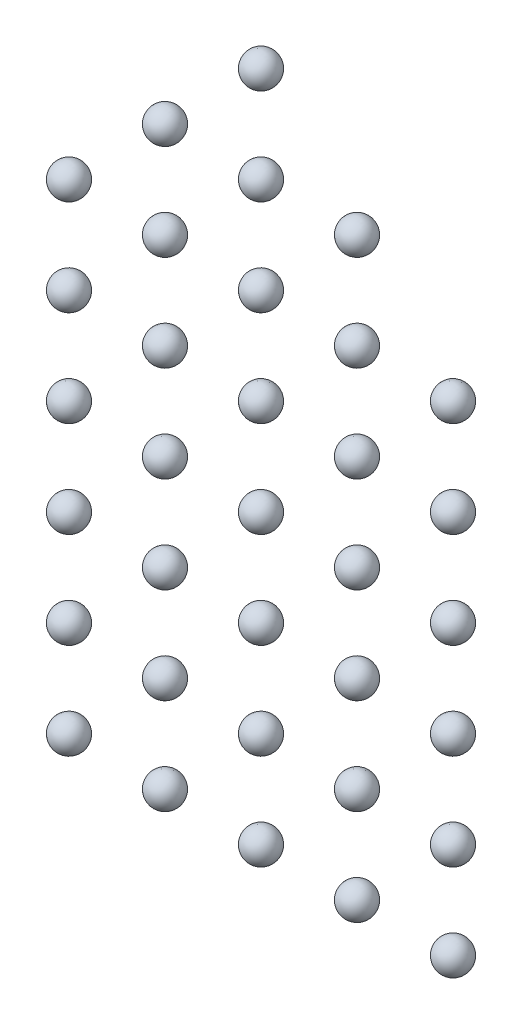
ISO-10303-21;
HEADER;
FILE_DESCRIPTION(('STEP AP214'),'2;1');
FILE_NAME('part.step','',(''),(''),'','','');
FILE_SCHEMA(('AUTOMOTIVE_DESIGN { 1 0 10303 214 1 1 1 1 }'));
ENDSEC;
DATA;
#1=APPLICATION_CONTEXT('core data for automotive mechanical design processes');
#2=APPLICATION_PROTOCOL_DEFINITION('international standard','automotive_design',2000,#1);
#3=PRODUCT_CONTEXT('',#1,'mechanical');
#4=PRODUCT('Part','Part','',(#3));
#5=PRODUCT_RELATED_PRODUCT_CATEGORY('part','',(#4));
#6=PRODUCT_DEFINITION_FORMATION('','',#4);
#7=PRODUCT_DEFINITION_CONTEXT('part definition',#1,'design');
#8=PRODUCT_DEFINITION('design','',#6,#7);
#9=PRODUCT_DEFINITION_SHAPE('','',#8);
#10=(LENGTH_UNIT() NAMED_UNIT(*) SI_UNIT(.MILLI.,.METRE.));
#11=(NAMED_UNIT(*) PLANE_ANGLE_UNIT() SI_UNIT($,.RADIAN.));
#12=(NAMED_UNIT(*) SI_UNIT($,.STERADIAN.) SOLID_ANGLE_UNIT());
#13=UNCERTAINTY_MEASURE_WITH_UNIT(LENGTH_MEASURE(1.E-05),#10,'distance_accuracy_value','');
#14=(GEOMETRIC_REPRESENTATION_CONTEXT(3) GLOBAL_UNCERTAINTY_ASSIGNED_CONTEXT((#13)) GLOBAL_UNIT_ASSIGNED_CONTEXT((#10,
#11,#12)) REPRESENTATION_CONTEXT('',''));
#15=CARTESIAN_POINT('',(0.,0.,0.));
#16=DIRECTION('',(0.,0.,1.));
#17=DIRECTION('',(1.,0.,0.));
#18=AXIS2_PLACEMENT_3D('',#15,#16,#17);
#19=CARTESIAN_POINT('',(6.,21.,0.));
#20=DIRECTION('',(-1.,0.,0.));
#21=DIRECTION('',(0.,1.,0.));
#22=AXIS2_PLACEMENT_3D('',#19,#20,#21);
#23=SPHERICAL_SURFACE('',#22,0.5);
#24=CARTESIAN_POINT('',(5.5,21.,0.));
#25=VERTEX_POINT('',#24);
#26=VERTEX_LOOP('',#25);
#27=FACE_BOUND('',#26,.T.);
#28=ADVANCED_FACE('F44',(#27),#23,.T.);
#29=CLOSED_SHELL('',(#28));
#30=MANIFOLD_SOLID_BREP('B2',#29);
#31=CARTESIAN_POINT('',(3.,18.,0.));
#32=DIRECTION('',(-1.,0.,0.));
#33=DIRECTION('',(0.,1.,0.));
#34=AXIS2_PLACEMENT_3D('',#31,#32,#33);
#35=SPHERICAL_SURFACE('',#34,0.5);
#36=CARTESIAN_POINT('',(2.5,18.,0.));
#37=VERTEX_POINT('',#36);
#38=VERTEX_LOOP('',#37);
#39=FACE_BOUND('',#38,.T.);
#40=ADVANCED_FACE('F65',(#39),#35,.T.);
#41=CLOSED_SHELL('',(#40));
#42=MANIFOLD_SOLID_BREP('B6',#41);
#43=CARTESIAN_POINT('',(6.,18.,0.));
#44=DIRECTION('',(-1.,0.,0.));
#45=DIRECTION('',(0.,1.,0.));
#46=AXIS2_PLACEMENT_3D('',#43,#44,#45);
#47=SPHERICAL_SURFACE('',#46,0.5);
#48=CARTESIAN_POINT('',(5.5,18.,0.));
#49=VERTEX_POINT('',#48);
#50=VERTEX_LOOP('',#49);
#51=FACE_BOUND('',#50,.T.);
#52=ADVANCED_FACE('F86',(#51),#47,.T.);
#53=CLOSED_SHELL('',(#52));
#54=MANIFOLD_SOLID_BREP('B40',#53);
#55=CARTESIAN_POINT('',(9.,18.,0.));
#56=DIRECTION('',(-1.,0.,0.));
#57=DIRECTION('',(0.,1.,0.));
#58=AXIS2_PLACEMENT_3D('',#55,#56,#57);
#59=SPHERICAL_SURFACE('',#58,0.5);
#60=CARTESIAN_POINT('',(8.5,18.,0.));
#61=VERTEX_POINT('',#60);
#62=VERTEX_LOOP('',#61);
#63=FACE_BOUND('',#62,.T.);
#64=ADVANCED_FACE('F107',(#63),#59,.T.);
#65=CLOSED_SHELL('',(#64));
#66=MANIFOLD_SOLID_BREP('B61',#65);
#67=CARTESIAN_POINT('',(12.,15.,0.));
#68=DIRECTION('',(-1.,0.,0.));
#69=DIRECTION('',(0.,1.,0.));
#70=AXIS2_PLACEMENT_3D('',#67,#68,#69);
#71=SPHERICAL_SURFACE('',#70,0.5);
#72=CARTESIAN_POINT('',(11.5,15.,0.));
#73=VERTEX_POINT('',#72);
#74=VERTEX_LOOP('',#73);
#75=FACE_BOUND('',#74,.T.);
#76=ADVANCED_FACE('F128',(#75),#71,.T.);
#77=CLOSED_SHELL('',(#76));
#78=MANIFOLD_SOLID_BREP('B82',#77);
#79=CARTESIAN_POINT('',(9.,15.,0.));
#80=DIRECTION('',(-1.,0.,0.));
#81=DIRECTION('',(0.,1.,0.));
#82=AXIS2_PLACEMENT_3D('',#79,#80,#81);
#83=SPHERICAL_SURFACE('',#82,0.5);
#84=CARTESIAN_POINT('',(8.5,15.,0.));
#85=VERTEX_POINT('',#84);
#86=VERTEX_LOOP('',#85);
#87=FACE_BOUND('',#86,.T.);
#88=ADVANCED_FACE('F149',(#87),#83,.T.);
#89=CLOSED_SHELL('',(#88));
#90=MANIFOLD_SOLID_BREP('B103',#89);
#91=CARTESIAN_POINT('',(6.,15.,0.));
#92=DIRECTION('',(-1.,0.,0.));
#93=DIRECTION('',(0.,1.,0.));
#94=AXIS2_PLACEMENT_3D('',#91,#92,#93);
#95=SPHERICAL_SURFACE('',#94,0.5);
#96=CARTESIAN_POINT('',(5.5,15.,0.));
#97=VERTEX_POINT('',#96);
#98=VERTEX_LOOP('',#97);
#99=FACE_BOUND('',#98,.T.);
#100=ADVANCED_FACE('F170',(#99),#95,.T.);
#101=CLOSED_SHELL('',(#100));
#102=MANIFOLD_SOLID_BREP('B124',#101);
#103=CARTESIAN_POINT('',(3.,15.,0.));
#104=DIRECTION('',(-1.,0.,0.));
#105=DIRECTION('',(0.,1.,0.));
#106=AXIS2_PLACEMENT_3D('',#103,#104,#105);
#107=SPHERICAL_SURFACE('',#106,0.5);
#108=CARTESIAN_POINT('',(2.5,15.,0.));
#109=VERTEX_POINT('',#108);
#110=VERTEX_LOOP('',#109);
#111=FACE_BOUND('',#110,.T.);
#112=ADVANCED_FACE('F191',(#111),#107,.T.);
#113=CLOSED_SHELL('',(#112));
#114=MANIFOLD_SOLID_BREP('B145',#113);
#115=CARTESIAN_POINT('',(0.,15.,0.));
#116=DIRECTION('',(-1.,0.,0.));
#117=DIRECTION('',(0.,1.,0.));
#118=AXIS2_PLACEMENT_3D('',#115,#116,#117);
#119=SPHERICAL_SURFACE('',#118,0.5);
#120=CARTESIAN_POINT('',(-0.5,15.,0.));
#121=VERTEX_POINT('',#120);
#122=VERTEX_LOOP('',#121);
#123=FACE_BOUND('',#122,.T.);
#124=ADVANCED_FACE('F212',(#123),#119,.T.);
#125=CLOSED_SHELL('',(#124));
#126=MANIFOLD_SOLID_BREP('B166',#125);
#127=CARTESIAN_POINT('',(12.,12.,0.));
#128=DIRECTION('',(-1.,0.,0.));
#129=DIRECTION('',(0.,1.,0.));
#130=AXIS2_PLACEMENT_3D('',#127,#128,#129);
#131=SPHERICAL_SURFACE('',#130,0.5);
#132=CARTESIAN_POINT('',(11.5,12.,0.));
#133=VERTEX_POINT('',#132);
#134=VERTEX_LOOP('',#133);
#135=FACE_BOUND('',#134,.T.);
#136=ADVANCED_FACE('F233',(#135),#131,.T.);
#137=CLOSED_SHELL('',(#136));
#138=MANIFOLD_SOLID_BREP('B187',#137);
#139=CARTESIAN_POINT('',(9.,12.,0.));
#140=DIRECTION('',(-1.,0.,0.));
#141=DIRECTION('',(0.,1.,0.));
#142=AXIS2_PLACEMENT_3D('',#139,#140,#141);
#143=SPHERICAL_SURFACE('',#142,0.5);
#144=CARTESIAN_POINT('',(8.5,12.,0.));
#145=VERTEX_POINT('',#144);
#146=VERTEX_LOOP('',#145);
#147=FACE_BOUND('',#146,.T.);
#148=ADVANCED_FACE('F254',(#147),#143,.T.);
#149=CLOSED_SHELL('',(#148));
#150=MANIFOLD_SOLID_BREP('B208',#149);
#151=CARTESIAN_POINT('',(6.,12.,0.));
#152=DIRECTION('',(-1.,0.,0.));
#153=DIRECTION('',(0.,1.,0.));
#154=AXIS2_PLACEMENT_3D('',#151,#152,#153);
#155=SPHERICAL_SURFACE('',#154,0.5);
#156=CARTESIAN_POINT('',(5.5,12.,0.));
#157=VERTEX_POINT('',#156);
#158=VERTEX_LOOP('',#157);
#159=FACE_BOUND('',#158,.T.);
#160=ADVANCED_FACE('F275',(#159),#155,.T.);
#161=CLOSED_SHELL('',(#160));
#162=MANIFOLD_SOLID_BREP('B229',#161);
#163=CARTESIAN_POINT('',(3.,12.,0.));
#164=DIRECTION('',(-1.,0.,0.));
#165=DIRECTION('',(0.,1.,0.));
#166=AXIS2_PLACEMENT_3D('',#163,#164,#165);
#167=SPHERICAL_SURFACE('',#166,0.5);
#168=CARTESIAN_POINT('',(2.5,12.,0.));
#169=VERTEX_POINT('',#168);
#170=VERTEX_LOOP('',#169);
#171=FACE_BOUND('',#170,.T.);
#172=ADVANCED_FACE('F296',(#171),#167,.T.);
#173=CLOSED_SHELL('',(#172));
#174=MANIFOLD_SOLID_BREP('B250',#173);
#175=CARTESIAN_POINT('',(0.,12.,0.));
#176=DIRECTION('',(-1.,0.,0.));
#177=DIRECTION('',(0.,1.,0.));
#178=AXIS2_PLACEMENT_3D('',#175,#176,#177);
#179=SPHERICAL_SURFACE('',#178,0.5);
#180=CARTESIAN_POINT('',(-0.5,12.,0.));
#181=VERTEX_POINT('',#180);
#182=VERTEX_LOOP('',#181);
#183=FACE_BOUND('',#182,.T.);
#184=ADVANCED_FACE('F317',(#183),#179,.T.);
#185=CLOSED_SHELL('',(#184));
#186=MANIFOLD_SOLID_BREP('B271',#185);
#187=CARTESIAN_POINT('',(12.,9.,0.));
#188=DIRECTION('',(-1.,0.,0.));
#189=DIRECTION('',(0.,1.,0.));
#190=AXIS2_PLACEMENT_3D('',#187,#188,#189);
#191=SPHERICAL_SURFACE('',#190,0.5);
#192=CARTESIAN_POINT('',(11.5,9.,0.));
#193=VERTEX_POINT('',#192);
#194=VERTEX_LOOP('',#193);
#195=FACE_BOUND('',#194,.T.);
#196=ADVANCED_FACE('F338',(#195),#191,.T.);
#197=CLOSED_SHELL('',(#196));
#198=MANIFOLD_SOLID_BREP('B292',#197);
#199=CARTESIAN_POINT('',(9.,9.,0.));
#200=DIRECTION('',(-1.,0.,0.));
#201=DIRECTION('',(0.,1.,0.));
#202=AXIS2_PLACEMENT_3D('',#199,#200,#201);
#203=SPHERICAL_SURFACE('',#202,0.5);
#204=CARTESIAN_POINT('',(8.5,9.,0.));
#205=VERTEX_POINT('',#204);
#206=VERTEX_LOOP('',#205);
#207=FACE_BOUND('',#206,.T.);
#208=ADVANCED_FACE('F359',(#207),#203,.T.);
#209=CLOSED_SHELL('',(#208));
#210=MANIFOLD_SOLID_BREP('B313',#209);
#211=CARTESIAN_POINT('',(6.,9.,0.));
#212=DIRECTION('',(-1.,0.,0.));
#213=DIRECTION('',(0.,1.,0.));
#214=AXIS2_PLACEMENT_3D('',#211,#212,#213);
#215=SPHERICAL_SURFACE('',#214,0.5);
#216=CARTESIAN_POINT('',(5.5,9.,0.));
#217=VERTEX_POINT('',#216);
#218=VERTEX_LOOP('',#217);
#219=FACE_BOUND('',#218,.T.);
#220=ADVANCED_FACE('F380',(#219),#215,.T.);
#221=CLOSED_SHELL('',(#220));
#222=MANIFOLD_SOLID_BREP('B334',#221);
#223=CARTESIAN_POINT('',(3.,9.,0.));
#224=DIRECTION('',(-1.,0.,0.));
#225=DIRECTION('',(0.,1.,0.));
#226=AXIS2_PLACEMENT_3D('',#223,#224,#225);
#227=SPHERICAL_SURFACE('',#226,0.5);
#228=CARTESIAN_POINT('',(2.5,9.,0.));
#229=VERTEX_POINT('',#228);
#230=VERTEX_LOOP('',#229);
#231=FACE_BOUND('',#230,.T.);
#232=ADVANCED_FACE('F401',(#231),#227,.T.);
#233=CLOSED_SHELL('',(#232));
#234=MANIFOLD_SOLID_BREP('B355',#233);
#235=CARTESIAN_POINT('',(0.,9.,0.));
#236=DIRECTION('',(-1.,0.,0.));
#237=DIRECTION('',(0.,1.,0.));
#238=AXIS2_PLACEMENT_3D('',#235,#236,#237);
#239=SPHERICAL_SURFACE('',#238,0.5);
#240=CARTESIAN_POINT('',(-0.5,9.,0.));
#241=VERTEX_POINT('',#240);
#242=VERTEX_LOOP('',#241);
#243=FACE_BOUND('',#242,.T.);
#244=ADVANCED_FACE('F422',(#243),#239,.T.);
#245=CLOSED_SHELL('',(#244));
#246=MANIFOLD_SOLID_BREP('B376',#245);
#247=CARTESIAN_POINT('',(12.,6.,0.));
#248=DIRECTION('',(-1.,0.,0.));
#249=DIRECTION('',(0.,1.,0.));
#250=AXIS2_PLACEMENT_3D('',#247,#248,#249);
#251=SPHERICAL_SURFACE('',#250,0.5);
#252=CARTESIAN_POINT('',(11.5,6.,0.));
#253=VERTEX_POINT('',#252);
#254=VERTEX_LOOP('',#253);
#255=FACE_BOUND('',#254,.T.);
#256=ADVANCED_FACE('F443',(#255),#251,.T.);
#257=CLOSED_SHELL('',(#256));
#258=MANIFOLD_SOLID_BREP('B397',#257);
#259=CARTESIAN_POINT('',(9.,6.,0.));
#260=DIRECTION('',(-1.,0.,0.));
#261=DIRECTION('',(0.,1.,0.));
#262=AXIS2_PLACEMENT_3D('',#259,#260,#261);
#263=SPHERICAL_SURFACE('',#262,0.5);
#264=CARTESIAN_POINT('',(8.5,6.,0.));
#265=VERTEX_POINT('',#264);
#266=VERTEX_LOOP('',#265);
#267=FACE_BOUND('',#266,.T.);
#268=ADVANCED_FACE('F464',(#267),#263,.T.);
#269=CLOSED_SHELL('',(#268));
#270=MANIFOLD_SOLID_BREP('B418',#269);
#271=CARTESIAN_POINT('',(6.,6.,0.));
#272=DIRECTION('',(-1.,0.,0.));
#273=DIRECTION('',(0.,1.,0.));
#274=AXIS2_PLACEMENT_3D('',#271,#272,#273);
#275=SPHERICAL_SURFACE('',#274,0.5);
#276=CARTESIAN_POINT('',(5.5,6.,0.));
#277=VERTEX_POINT('',#276);
#278=VERTEX_LOOP('',#277);
#279=FACE_BOUND('',#278,.T.);
#280=ADVANCED_FACE('F485',(#279),#275,.T.);
#281=CLOSED_SHELL('',(#280));
#282=MANIFOLD_SOLID_BREP('B439',#281);
#283=CARTESIAN_POINT('',(3.,6.,0.));
#284=DIRECTION('',(-1.,0.,0.));
#285=DIRECTION('',(0.,1.,0.));
#286=AXIS2_PLACEMENT_3D('',#283,#284,#285);
#287=SPHERICAL_SURFACE('',#286,0.5);
#288=CARTESIAN_POINT('',(2.5,6.,0.));
#289=VERTEX_POINT('',#288);
#290=VERTEX_LOOP('',#289);
#291=FACE_BOUND('',#290,.T.);
#292=ADVANCED_FACE('F506',(#291),#287,.T.);
#293=CLOSED_SHELL('',(#292));
#294=MANIFOLD_SOLID_BREP('B460',#293);
#295=CARTESIAN_POINT('',(0.,6.,0.));
#296=DIRECTION('',(-1.,0.,0.));
#297=DIRECTION('',(0.,1.,0.));
#298=AXIS2_PLACEMENT_3D('',#295,#296,#297);
#299=SPHERICAL_SURFACE('',#298,0.5);
#300=CARTESIAN_POINT('',(-0.5,6.,0.));
#301=VERTEX_POINT('',#300);
#302=VERTEX_LOOP('',#301);
#303=FACE_BOUND('',#302,.T.);
#304=ADVANCED_FACE('F527',(#303),#299,.T.);
#305=CLOSED_SHELL('',(#304));
#306=MANIFOLD_SOLID_BREP('B481',#305);
#307=CARTESIAN_POINT('',(12.,3.,0.));
#308=DIRECTION('',(-1.,0.,0.));
#309=DIRECTION('',(0.,1.,0.));
#310=AXIS2_PLACEMENT_3D('',#307,#308,#309);
#311=SPHERICAL_SURFACE('',#310,0.5);
#312=CARTESIAN_POINT('',(11.5,3.,0.));
#313=VERTEX_POINT('',#312);
#314=VERTEX_LOOP('',#313);
#315=FACE_BOUND('',#314,.T.);
#316=ADVANCED_FACE('F548',(#315),#311,.T.);
#317=CLOSED_SHELL('',(#316));
#318=MANIFOLD_SOLID_BREP('B502',#317);
#319=CARTESIAN_POINT('',(9.,3.,0.));
#320=DIRECTION('',(-1.,0.,0.));
#321=DIRECTION('',(0.,1.,0.));
#322=AXIS2_PLACEMENT_3D('',#319,#320,#321);
#323=SPHERICAL_SURFACE('',#322,0.5);
#324=CARTESIAN_POINT('',(8.5,3.,0.));
#325=VERTEX_POINT('',#324);
#326=VERTEX_LOOP('',#325);
#327=FACE_BOUND('',#326,.T.);
#328=ADVANCED_FACE('F569',(#327),#323,.T.);
#329=CLOSED_SHELL('',(#328));
#330=MANIFOLD_SOLID_BREP('B523',#329);
#331=CARTESIAN_POINT('',(6.,3.,0.));
#332=DIRECTION('',(-1.,0.,0.));
#333=DIRECTION('',(0.,1.,0.));
#334=AXIS2_PLACEMENT_3D('',#331,#332,#333);
#335=SPHERICAL_SURFACE('',#334,0.5);
#336=CARTESIAN_POINT('',(5.5,3.,0.));
#337=VERTEX_POINT('',#336);
#338=VERTEX_LOOP('',#337);
#339=FACE_BOUND('',#338,.T.);
#340=ADVANCED_FACE('F590',(#339),#335,.T.);
#341=CLOSED_SHELL('',(#340));
#342=MANIFOLD_SOLID_BREP('B544',#341);
#343=CARTESIAN_POINT('',(3.,3.,0.));
#344=DIRECTION('',(-1.,0.,0.));
#345=DIRECTION('',(0.,1.,0.));
#346=AXIS2_PLACEMENT_3D('',#343,#344,#345);
#347=SPHERICAL_SURFACE('',#346,0.5);
#348=CARTESIAN_POINT('',(2.5,3.,0.));
#349=VERTEX_POINT('',#348);
#350=VERTEX_LOOP('',#349);
#351=FACE_BOUND('',#350,.T.);
#352=ADVANCED_FACE('F611',(#351),#347,.T.);
#353=CLOSED_SHELL('',(#352));
#354=MANIFOLD_SOLID_BREP('B565',#353);
#355=CARTESIAN_POINT('',(0.,3.,0.));
#356=DIRECTION('',(-1.,0.,0.));
#357=DIRECTION('',(0.,1.,0.));
#358=AXIS2_PLACEMENT_3D('',#355,#356,#357);
#359=SPHERICAL_SURFACE('',#358,0.5);
#360=CARTESIAN_POINT('',(-0.5,3.,0.));
#361=VERTEX_POINT('',#360);
#362=VERTEX_LOOP('',#361);
#363=FACE_BOUND('',#362,.T.);
#364=ADVANCED_FACE('F632',(#363),#359,.T.);
#365=CLOSED_SHELL('',(#364));
#366=MANIFOLD_SOLID_BREP('B586',#365);
#367=CARTESIAN_POINT('',(12.,0.,0.));
#368=DIRECTION('',(-1.,0.,0.));
#369=DIRECTION('',(0.,1.,0.));
#370=AXIS2_PLACEMENT_3D('',#367,#368,#369);
#371=SPHERICAL_SURFACE('',#370,0.5);
#372=CARTESIAN_POINT('',(11.5,0.,0.));
#373=VERTEX_POINT('',#372);
#374=VERTEX_LOOP('',#373);
#375=FACE_BOUND('',#374,.T.);
#376=ADVANCED_FACE('F653',(#375),#371,.T.);
#377=CLOSED_SHELL('',(#376));
#378=MANIFOLD_SOLID_BREP('B607',#377);
#379=CARTESIAN_POINT('',(9.,0.,0.));
#380=DIRECTION('',(-1.,0.,0.));
#381=DIRECTION('',(0.,1.,0.));
#382=AXIS2_PLACEMENT_3D('',#379,#380,#381);
#383=SPHERICAL_SURFACE('',#382,0.5);
#384=CARTESIAN_POINT('',(8.5,0.,0.));
#385=VERTEX_POINT('',#384);
#386=VERTEX_LOOP('',#385);
#387=FACE_BOUND('',#386,.T.);
#388=ADVANCED_FACE('F674',(#387),#383,.T.);
#389=CLOSED_SHELL('',(#388));
#390=MANIFOLD_SOLID_BREP('B628',#389);
#391=CARTESIAN_POINT('',(6.,0.,0.));
#392=DIRECTION('',(-1.,0.,0.));
#393=DIRECTION('',(0.,1.,0.));
#394=AXIS2_PLACEMENT_3D('',#391,#392,#393);
#395=SPHERICAL_SURFACE('',#394,0.5);
#396=CARTESIAN_POINT('',(5.5,0.,0.));
#397=VERTEX_POINT('',#396);
#398=VERTEX_LOOP('',#397);
#399=FACE_BOUND('',#398,.T.);
#400=ADVANCED_FACE('F695',(#399),#395,.T.);
#401=CLOSED_SHELL('',(#400));
#402=MANIFOLD_SOLID_BREP('B649',#401);
#403=CARTESIAN_POINT('',(3.,0.,0.));
#404=DIRECTION('',(-1.,0.,0.));
#405=DIRECTION('',(0.,1.,0.));
#406=AXIS2_PLACEMENT_3D('',#403,#404,#405);
#407=SPHERICAL_SURFACE('',#406,0.5);
#408=CARTESIAN_POINT('',(2.5,0.,0.));
#409=VERTEX_POINT('',#408);
#410=VERTEX_LOOP('',#409);
#411=FACE_BOUND('',#410,.T.);
#412=ADVANCED_FACE('F715',(#411),#407,.T.);
#413=CLOSED_SHELL('',(#412));
#414=MANIFOLD_SOLID_BREP('B670',#413);
#415=CARTESIAN_POINT('',(0.,0.,0.));
#416=DIRECTION('',(-1.,0.,0.));
#417=DIRECTION('',(0.,1.,0.));
#418=AXIS2_PLACEMENT_3D('',#415,#416,#417);
#419=SPHERICAL_SURFACE('',#418,0.5);
#420=CARTESIAN_POINT('',(-0.5,0.,0.));
#421=VERTEX_POINT('',#420);
#422=VERTEX_LOOP('',#421);
#423=FACE_BOUND('',#422,.T.);
#424=ADVANCED_FACE('F730',(#423),#419,.T.);
#425=CLOSED_SHELL('',(#424));
#426=MANIFOLD_SOLID_BREP('B691',#425);
#427=ADVANCED_BREP_SHAPE_REPRESENTATION('',(#18,#30,#42,#54,#66,#78,#90,#102,#114,#126,#138,
#150,#162,#174,#186,#198,#210,#222,#234,#246,#258,#270,#282,#294,#306,#318,#330,#342,#354,#366,
#378,#390,#402,#414,#426),#14);
#428=SHAPE_DEFINITION_REPRESENTATION(#9,#427);
ENDSEC;
END-ISO-10303-21;
